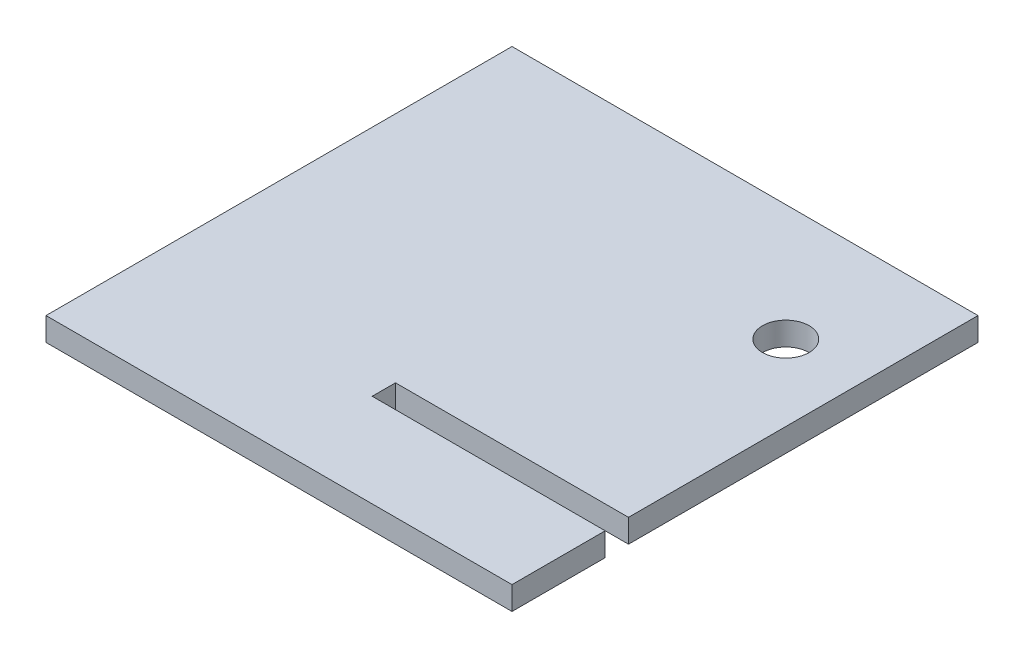
ISO-10303-21;
HEADER;
FILE_DESCRIPTION(('STEP AP214'),'2;1');
FILE_NAME('part.step','',(''),(''),'','','');
FILE_SCHEMA(('AUTOMOTIVE_DESIGN { 1 0 10303 214 1 1 1 1 }'));
ENDSEC;
DATA;
#1=APPLICATION_CONTEXT('core data for automotive mechanical design processes');
#2=APPLICATION_PROTOCOL_DEFINITION('international standard','automotive_design',2000,#1);
#3=PRODUCT_CONTEXT('',#1,'mechanical');
#4=PRODUCT('Part','Part','',(#3));
#5=PRODUCT_RELATED_PRODUCT_CATEGORY('part','',(#4));
#6=PRODUCT_DEFINITION_FORMATION('','',#4);
#7=PRODUCT_DEFINITION_CONTEXT('part definition',#1,'design');
#8=PRODUCT_DEFINITION('design','',#6,#7);
#9=PRODUCT_DEFINITION_SHAPE('','',#8);
#10=(LENGTH_UNIT() NAMED_UNIT(*) SI_UNIT(.MILLI.,.METRE.));
#11=(NAMED_UNIT(*) PLANE_ANGLE_UNIT() SI_UNIT($,.RADIAN.));
#12=(NAMED_UNIT(*) SI_UNIT($,.STERADIAN.) SOLID_ANGLE_UNIT());
#13=UNCERTAINTY_MEASURE_WITH_UNIT(LENGTH_MEASURE(1.E-05),#10,'distance_accuracy_value','');
#14=(GEOMETRIC_REPRESENTATION_CONTEXT(3) GLOBAL_UNCERTAINTY_ASSIGNED_CONTEXT((#13)) GLOBAL_UNIT_ASSIGNED_CONTEXT((#10,
#11,#12)) REPRESENTATION_CONTEXT('',''));
#15=CARTESIAN_POINT('',(0.,0.,0.));
#16=DIRECTION('',(0.,0.,1.));
#17=DIRECTION('',(1.,0.,0.));
#18=AXIS2_PLACEMENT_3D('',#15,#16,#17);
#19=CARTESIAN_POINT('',(127.,6.35,0.));
#20=DIRECTION('',(-1.,0.,0.));
#21=DIRECTION('',(0.,0.,1.));
#22=AXIS2_PLACEMENT_3D('',#19,#20,#21);
#23=PLANE('',#22);
#24=DIRECTION('',(0.,0.,-1.));
#25=VECTOR('',#24,1.);
#26=CARTESIAN_POINT('',(127.,-6.35,0.));
#27=LINE('',#26,#25);
#28=CARTESIAN_POINT('',(127.,-6.35,0.));
#29=VERTEX_POINT('',#28);
#30=CARTESIAN_POINT('',(127.,-6.35,-50.7999999999982));
#31=VERTEX_POINT('',#30);
#32=EDGE_CURVE('E139',#29,#31,#27,.T.);
#33=ORIENTED_EDGE('',*,*,#32,.T.);
#34=DIRECTION('',(0.,1.,0.));
#35=VECTOR('',#34,1.);
#36=CARTESIAN_POINT('',(127.,-6.35,-50.7999999999982));
#37=LINE('',#36,#35);
#38=CARTESIAN_POINT('',(127.,6.35,-50.7999999999982));
#39=VERTEX_POINT('',#38);
#40=EDGE_CURVE('E92',#31,#39,#37,.T.);
#41=ORIENTED_EDGE('',*,*,#40,.T.);
#42=DIRECTION('',(0.,0.,-1.));
#43=VECTOR('',#42,1.);
#44=CARTESIAN_POINT('',(127.,6.35,0.));
#45=LINE('',#44,#43);
#46=CARTESIAN_POINT('',(127.,6.35,0.));
#47=VERTEX_POINT('',#46);
#48=EDGE_CURVE('E131',#47,#39,#45,.T.);
#49=ORIENTED_EDGE('',*,*,#48,.F.);
#50=DIRECTION('',(0.,-1.,0.));
#51=VECTOR('',#50,1.);
#52=CARTESIAN_POINT('',(127.,6.35,0.));
#53=LINE('',#52,#51);
#54=EDGE_CURVE('E112',#47,#29,#53,.T.);
#55=ORIENTED_EDGE('',*,*,#54,.T.);
#56=EDGE_LOOP('',(#33,#41,#49,#55));
#57=FACE_BOUND('',#56,.T.);
#58=ADVANCED_FACE('F37',(#57),#23,.F.);
#59=CARTESIAN_POINT('',(-127.,6.35,0.));
#60=DIRECTION('',(1.,0.,0.));
#61=DIRECTION('',(0.,0.,-1.));
#62=AXIS2_PLACEMENT_3D('',#59,#60,#61);
#63=PLANE('',#62);
#64=DIRECTION('',(0.,0.,1.));
#65=VECTOR('',#64,1.);
#66=CARTESIAN_POINT('',(-127.,-6.35,0.));
#67=LINE('',#66,#65);
#68=CARTESIAN_POINT('',(-127.,-6.35,-254.));
#69=VERTEX_POINT('',#68);
#70=CARTESIAN_POINT('',(-127.,-6.35,0.));
#71=VERTEX_POINT('',#70);
#72=EDGE_CURVE('E118',#69,#71,#67,.T.);
#73=ORIENTED_EDGE('',*,*,#72,.T.);
#74=DIRECTION('',(0.,-1.,0.));
#75=VECTOR('',#74,1.);
#76=CARTESIAN_POINT('',(-127.,6.35,0.));
#77=LINE('',#76,#75);
#78=CARTESIAN_POINT('',(-127.,6.35,0.));
#79=VERTEX_POINT('',#78);
#80=EDGE_CURVE('E143',#79,#71,#77,.T.);
#81=ORIENTED_EDGE('',*,*,#80,.F.);
#82=DIRECTION('',(0.,0.,1.));
#83=VECTOR('',#82,1.);
#84=CARTESIAN_POINT('',(-127.,6.35,0.));
#85=LINE('',#84,#83);
#86=CARTESIAN_POINT('',(-127.,6.35,-254.));
#87=VERTEX_POINT('',#86);
#88=EDGE_CURVE('E119',#87,#79,#85,.T.);
#89=ORIENTED_EDGE('',*,*,#88,.F.);
#90=DIRECTION('',(0.,-1.,0.));
#91=VECTOR('',#90,1.);
#92=CARTESIAN_POINT('',(-127.,6.35,-254.));
#93=LINE('',#92,#91);
#94=EDGE_CURVE('E107',#87,#69,#93,.T.);
#95=ORIENTED_EDGE('',*,*,#94,.T.);
#96=EDGE_LOOP('',(#73,#81,#89,#95));
#97=FACE_BOUND('',#96,.T.);
#98=ADVANCED_FACE('F116',(#97),#63,.F.);
#99=CARTESIAN_POINT('',(-127.,6.35,0.));
#100=DIRECTION('',(0.,0.,-1.));
#101=DIRECTION('',(-1.,0.,0.));
#102=AXIS2_PLACEMENT_3D('',#99,#100,#101);
#103=PLANE('',#102);
#104=DIRECTION('',(1.,0.,0.));
#105=VECTOR('',#104,1.);
#106=CARTESIAN_POINT('',(-127.,-6.35,0.));
#107=LINE('',#106,#105);
#108=EDGE_CURVE('E61',#71,#29,#107,.T.);
#109=ORIENTED_EDGE('',*,*,#108,.T.);
#110=ORIENTED_EDGE('',*,*,#54,.F.);
#111=DIRECTION('',(1.,0.,0.));
#112=VECTOR('',#111,1.);
#113=CARTESIAN_POINT('',(-127.,6.35,0.));
#114=LINE('',#113,#112);
#115=EDGE_CURVE('E80',#79,#47,#114,.T.);
#116=ORIENTED_EDGE('',*,*,#115,.F.);
#117=ORIENTED_EDGE('',*,*,#80,.T.);
#118=EDGE_LOOP('',(#109,#110,#116,#117));
#119=FACE_BOUND('',#118,.T.);
#120=ADVANCED_FACE('F187',(#119),#103,.F.);
#121=CARTESIAN_POINT('',(127.,6.35,-63.4999999999982));
#122=VERTEX_POINT('',#121);
#123=CARTESIAN_POINT('',(127.,6.35,-254.));
#124=VERTEX_POINT('',#123);
#125=EDGE_CURVE('E134',#122,#124,#45,.T.);
#126=ORIENTED_EDGE('',*,*,#125,.F.);
#127=DIRECTION('',(0.,1.,0.));
#128=VECTOR('',#127,1.);
#129=CARTESIAN_POINT('',(127.,-6.35,-63.4999999999982));
#130=LINE('',#129,#128);
#131=CARTESIAN_POINT('',(127.,-6.35,-63.4999999999982));
#132=VERTEX_POINT('',#131);
#133=EDGE_CURVE('E149',#132,#122,#130,.T.);
#134=ORIENTED_EDGE('',*,*,#133,.F.);
#135=CARTESIAN_POINT('',(127.,-6.35,-254.));
#136=VERTEX_POINT('',#135);
#137=EDGE_CURVE('E141',#132,#136,#27,.T.);
#138=ORIENTED_EDGE('',*,*,#137,.T.);
#139=DIRECTION('',(0.,-1.,0.));
#140=VECTOR('',#139,1.);
#141=CARTESIAN_POINT('',(127.,6.35,-254.));
#142=LINE('',#141,#140);
#143=EDGE_CURVE('E110',#124,#136,#142,.T.);
#144=ORIENTED_EDGE('',*,*,#143,.F.);
#145=EDGE_LOOP('',(#126,#134,#138,#144));
#146=FACE_BOUND('',#145,.T.);
#147=ADVANCED_FACE('F185',(#146),#23,.F.);
#148=CARTESIAN_POINT('',(-127.,6.35,-254.));
#149=DIRECTION('',(0.,0.,1.));
#150=DIRECTION('',(1.,0.,0.));
#151=AXIS2_PLACEMENT_3D('',#148,#149,#150);
#152=PLANE('',#151);
#153=DIRECTION('',(-1.,0.,0.));
#154=VECTOR('',#153,1.);
#155=CARTESIAN_POINT('',(-127.,-6.35,-254.));
#156=LINE('',#155,#154);
#157=EDGE_CURVE('E103',#136,#69,#156,.T.);
#158=ORIENTED_EDGE('',*,*,#157,.T.);
#159=ORIENTED_EDGE('',*,*,#94,.F.);
#160=DIRECTION('',(-1.,0.,0.));
#161=VECTOR('',#160,1.);
#162=CARTESIAN_POINT('',(-127.,6.35,-254.));
#163=LINE('',#162,#161);
#164=EDGE_CURVE('E129',#124,#87,#163,.T.);
#165=ORIENTED_EDGE('',*,*,#164,.F.);
#166=ORIENTED_EDGE('',*,*,#143,.T.);
#167=EDGE_LOOP('',(#158,#159,#165,#166));
#168=FACE_BOUND('',#167,.T.);
#169=ADVANCED_FACE('F105',(#168),#152,.F.);
#170=CARTESIAN_POINT('',(0.,6.35,0.));
#171=DIRECTION('',(0.,-1.,0.));
#172=DIRECTION('',(0.,0.,-1.));
#173=AXIS2_PLACEMENT_3D('',#170,#171,#172);
#174=PLANE('',#173);
#175=CARTESIAN_POINT('',(85.7500000000019,6.34999999999999,-190.5));
#176=DIRECTION('',(0.,-1.,0.));
#177=DIRECTION('',(0.,0.,-1.));
#178=AXIS2_PLACEMENT_3D('',#175,#176,#177);
#179=CIRCLE('',#178,12.7);
#180=CARTESIAN_POINT('',(85.7500000000019,6.34999999999999,-203.2));
#181=VERTEX_POINT('',#180);
#182=EDGE_CURVE('E11',#181,#181,#179,.F.);
#183=ORIENTED_EDGE('',*,*,#182,.F.);
#184=EDGE_LOOP('',(#183));
#185=FACE_BOUND('',#184,.T.);
#186=ORIENTED_EDGE('',*,*,#48,.T.);
#187=DIRECTION('',(1.,0.,0.));
#188=VECTOR('',#187,1.);
#189=CARTESIAN_POINT('',(127.,6.35,-50.7999999999982));
#190=LINE('',#189,#188);
#191=CARTESIAN_POINT('',(0.,6.35,-50.7999999999982));
#192=VERTEX_POINT('',#191);
#193=EDGE_CURVE('E162',#192,#39,#190,.T.);
#194=ORIENTED_EDGE('',*,*,#193,.F.);
#195=DIRECTION('',(0.,0.,1.));
#196=VECTOR('',#195,1.);
#197=CARTESIAN_POINT('',(0.,6.35,-63.4999999999982));
#198=LINE('',#197,#196);
#199=CARTESIAN_POINT('',(0.,6.35,-63.4999999999982));
#200=VERTEX_POINT('',#199);
#201=EDGE_CURVE('E164',#200,#192,#198,.T.);
#202=ORIENTED_EDGE('',*,*,#201,.F.);
#203=DIRECTION('',(-1.,0.,0.));
#204=VECTOR('',#203,1.);
#205=CARTESIAN_POINT('',(127.,6.35,-63.4999999999982));
#206=LINE('',#205,#204);
#207=EDGE_CURVE('E167',#122,#200,#206,.T.);
#208=ORIENTED_EDGE('',*,*,#207,.F.);
#209=ORIENTED_EDGE('',*,*,#125,.T.);
#210=ORIENTED_EDGE('',*,*,#164,.T.);
#211=ORIENTED_EDGE('',*,*,#88,.T.);
#212=ORIENTED_EDGE('',*,*,#115,.T.);
#213=EDGE_LOOP('',(#186,#194,#202,#208,#209,#210,#211,#212));
#214=FACE_BOUND('',#213,.T.);
#215=ADVANCED_FACE('F39',(#185,#214),#174,.F.);
#216=CARTESIAN_POINT('',(0.,-6.35,0.));
#217=DIRECTION('',(0.,-1.,0.));
#218=DIRECTION('',(0.,0.,-1.));
#219=AXIS2_PLACEMENT_3D('',#216,#217,#218);
#220=PLANE('',#219);
#221=DIRECTION('',(1.,0.,0.));
#222=VECTOR('',#221,1.);
#223=CARTESIAN_POINT('',(127.,-6.35,-50.7999999999982));
#224=LINE('',#223,#222);
#225=CARTESIAN_POINT('',(0.,-6.35,-50.7999999999982));
#226=VERTEX_POINT('',#225);
#227=EDGE_CURVE('E153',#226,#31,#224,.T.);
#228=ORIENTED_EDGE('',*,*,#227,.T.);
#229=ORIENTED_EDGE('',*,*,#32,.F.);
#230=ORIENTED_EDGE('',*,*,#108,.F.);
#231=ORIENTED_EDGE('',*,*,#72,.F.);
#232=ORIENTED_EDGE('',*,*,#157,.F.);
#233=ORIENTED_EDGE('',*,*,#137,.F.);
#234=DIRECTION('',(-1.,0.,0.));
#235=VECTOR('',#234,1.);
#236=CARTESIAN_POINT('',(127.,-6.35,-63.4999999999982));
#237=LINE('',#236,#235);
#238=CARTESIAN_POINT('',(0.,-6.35,-63.4999999999982));
#239=VERTEX_POINT('',#238);
#240=EDGE_CURVE('E159',#132,#239,#237,.T.);
#241=ORIENTED_EDGE('',*,*,#240,.T.);
#242=DIRECTION('',(0.,0.,1.));
#243=VECTOR('',#242,1.);
#244=CARTESIAN_POINT('',(0.,-6.35,-63.4999999999982));
#245=LINE('',#244,#243);
#246=EDGE_CURVE('E52',#239,#226,#245,.T.);
#247=ORIENTED_EDGE('',*,*,#246,.T.);
#248=EDGE_LOOP('',(#228,#229,#230,#231,#232,#233,#241,#247));
#249=FACE_BOUND('',#248,.T.);
#250=CARTESIAN_POINT('',(85.7500000000018,-6.34999999999999,-190.5));
#251=DIRECTION('',(0.,-1.,0.));
#252=DIRECTION('',(0.,0.,-1.));
#253=AXIS2_PLACEMENT_3D('',#250,#251,#252);
#254=CIRCLE('',#253,12.7);
#255=CARTESIAN_POINT('',(85.7500000000018,-6.34999999999999,-203.2));
#256=VERTEX_POINT('',#255);
#257=EDGE_CURVE('E45',#256,#256,#254,.F.);
#258=ORIENTED_EDGE('',*,*,#257,.T.);
#259=EDGE_LOOP('',(#258));
#260=FACE_BOUND('',#259,.T.);
#261=ADVANCED_FACE('F121',(#249,#260),#220,.T.);
#262=CARTESIAN_POINT('',(85.7500000000011,-69.8500000000023,-190.5));
#263=DIRECTION('',(0.,1.,0.));
#264=DIRECTION('',(-1.,0.,0.));
#265=AXIS2_PLACEMENT_3D('',#262,#263,#264);
#266=CYLINDRICAL_SURFACE('',#265,12.7);
#267=ORIENTED_EDGE('',*,*,#257,.F.);
#268=EDGE_LOOP('',(#267));
#269=FACE_BOUND('',#268,.T.);
#270=ORIENTED_EDGE('',*,*,#182,.T.);
#271=EDGE_LOOP('',(#270));
#272=FACE_BOUND('',#271,.T.);
#273=ADVANCED_FACE('F209',(#269,#272),#266,.F.);
#274=CARTESIAN_POINT('',(127.,-6.35,-50.7999999999982));
#275=DIRECTION('',(0.,0.,1.));
#276=DIRECTION('',(1.,0.,0.));
#277=AXIS2_PLACEMENT_3D('',#274,#275,#276);
#278=PLANE('',#277);
#279=ORIENTED_EDGE('',*,*,#40,.F.);
#280=ORIENTED_EDGE('',*,*,#227,.F.);
#281=DIRECTION('',(0.,1.,0.));
#282=VECTOR('',#281,1.);
#283=CARTESIAN_POINT('',(0.,-6.35,-50.7999999999982));
#284=LINE('',#283,#282);
#285=EDGE_CURVE('E124',#226,#192,#284,.T.);
#286=ORIENTED_EDGE('',*,*,#285,.T.);
#287=ORIENTED_EDGE('',*,*,#193,.T.);
#288=EDGE_LOOP('',(#279,#280,#286,#287));
#289=FACE_BOUND('',#288,.T.);
#290=ADVANCED_FACE('F207',(#289),#278,.F.);
#291=CARTESIAN_POINT('',(0.,-6.35,-63.4999999999982));
#292=DIRECTION('',(-1.,0.,0.));
#293=DIRECTION('',(0.,0.,1.));
#294=AXIS2_PLACEMENT_3D('',#291,#292,#293);
#295=PLANE('',#294);
#296=ORIENTED_EDGE('',*,*,#285,.F.);
#297=ORIENTED_EDGE('',*,*,#246,.F.);
#298=DIRECTION('',(0.,1.,0.));
#299=VECTOR('',#298,1.);
#300=CARTESIAN_POINT('',(0.,-6.35,-63.4999999999982));
#301=LINE('',#300,#299);
#302=EDGE_CURVE('E152',#239,#200,#301,.T.);
#303=ORIENTED_EDGE('',*,*,#302,.T.);
#304=ORIENTED_EDGE('',*,*,#201,.T.);
#305=EDGE_LOOP('',(#296,#297,#303,#304));
#306=FACE_BOUND('',#305,.T.);
#307=ADVANCED_FACE('F180',(#306),#295,.F.);
#308=CARTESIAN_POINT('',(127.,-6.35,-63.4999999999982));
#309=DIRECTION('',(0.,0.,-1.));
#310=DIRECTION('',(-1.,0.,0.));
#311=AXIS2_PLACEMENT_3D('',#308,#309,#310);
#312=PLANE('',#311);
#313=ORIENTED_EDGE('',*,*,#302,.F.);
#314=ORIENTED_EDGE('',*,*,#240,.F.);
#315=ORIENTED_EDGE('',*,*,#133,.T.);
#316=ORIENTED_EDGE('',*,*,#207,.T.);
#317=EDGE_LOOP('',(#313,#314,#315,#316));
#318=FACE_BOUND('',#317,.T.);
#319=ADVANCED_FACE('F173',(#318),#312,.F.);
#320=CLOSED_SHELL('',(#58,#98,#120,#147,#169,#215,#261,#273,#290,#307,#319));
#321=MANIFOLD_SOLID_BREP('B2',#320);
#322=ADVANCED_BREP_SHAPE_REPRESENTATION('',(#18,#321),#14);
#323=SHAPE_DEFINITION_REPRESENTATION(#9,#322);
ENDSEC;
END-ISO-10303-21;
